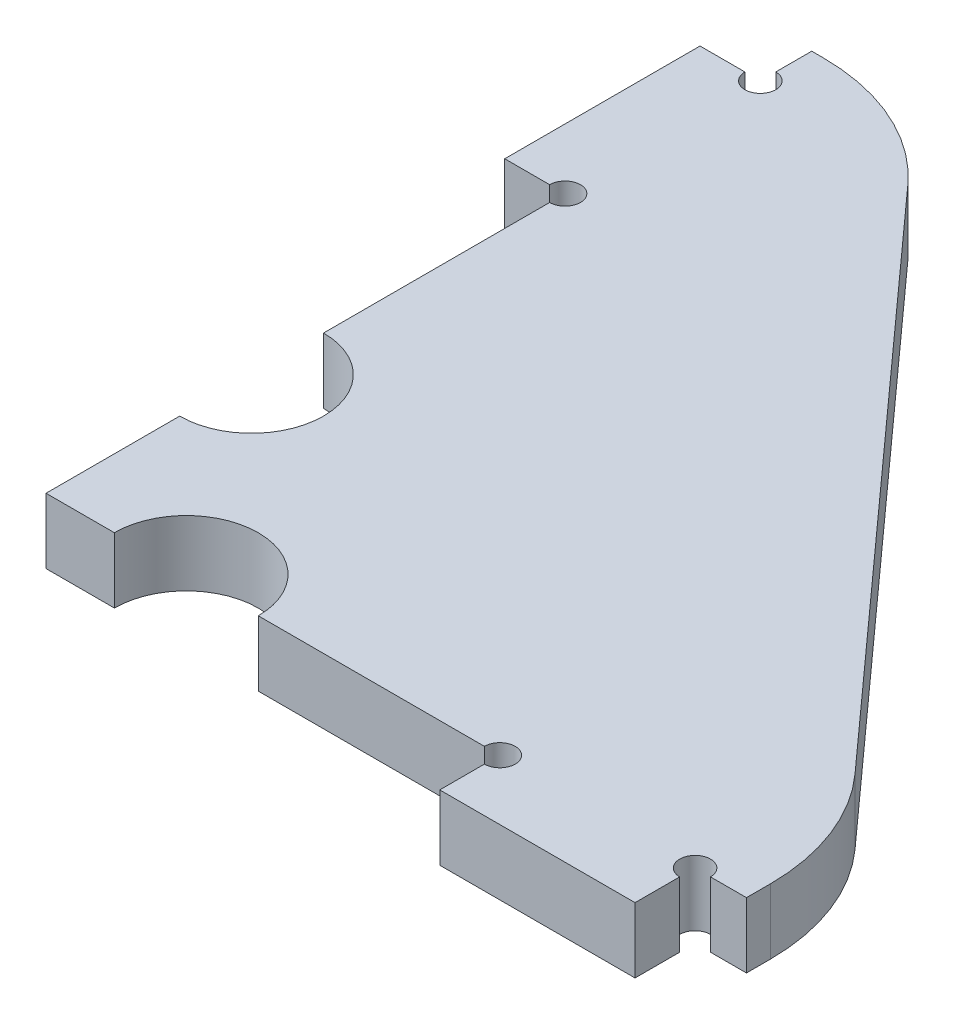
ISO-10303-21;
HEADER;
FILE_DESCRIPTION(('STEP AP214'),'2;1');
FILE_NAME('part.step','',(''),(''),'','','');
FILE_SCHEMA(('AUTOMOTIVE_DESIGN { 1 0 10303 214 1 1 1 1 }'));
ENDSEC;
DATA;
#1=APPLICATION_CONTEXT('core data for automotive mechanical design processes');
#2=APPLICATION_PROTOCOL_DEFINITION('international standard','automotive_design',2000,#1);
#3=PRODUCT_CONTEXT('',#1,'mechanical');
#4=PRODUCT('Part','Part','',(#3));
#5=PRODUCT_RELATED_PRODUCT_CATEGORY('part','',(#4));
#6=PRODUCT_DEFINITION_FORMATION('','',#4);
#7=PRODUCT_DEFINITION_CONTEXT('part definition',#1,'design');
#8=PRODUCT_DEFINITION('design','',#6,#7);
#9=PRODUCT_DEFINITION_SHAPE('','',#8);
#10=(LENGTH_UNIT() NAMED_UNIT(*) SI_UNIT(.MILLI.,.METRE.));
#11=(NAMED_UNIT(*) PLANE_ANGLE_UNIT() SI_UNIT($,.RADIAN.));
#12=(NAMED_UNIT(*) SI_UNIT($,.STERADIAN.) SOLID_ANGLE_UNIT());
#13=UNCERTAINTY_MEASURE_WITH_UNIT(LENGTH_MEASURE(1.E-05),#10,'distance_accuracy_value','');
#14=(GEOMETRIC_REPRESENTATION_CONTEXT(3) GLOBAL_UNCERTAINTY_ASSIGNED_CONTEXT((#13)) GLOBAL_UNIT_ASSIGNED_CONTEXT((#10,
#11,#12)) REPRESENTATION_CONTEXT('',''));
#15=CARTESIAN_POINT('',(0.,0.,0.));
#16=DIRECTION('',(0.,0.,1.));
#17=DIRECTION('',(1.,0.,0.));
#18=AXIS2_PLACEMENT_3D('',#15,#16,#17);
#19=CARTESIAN_POINT('',(0.,6.35,0.));
#20=DIRECTION('',(1.,0.,0.));
#21=DIRECTION('',(0.,0.,-1.));
#22=AXIS2_PLACEMENT_3D('',#19,#20,#21);
#23=PLANE('',#22);
#24=DIRECTION('',(0.,0.,1.));
#25=VECTOR('',#24,1.);
#26=CARTESIAN_POINT('',(0.,6.35,0.));
#27=LINE('',#26,#25);
#28=CARTESIAN_POINT('',(0.,6.35,-49.));
#29=VERTEX_POINT('',#28);
#30=CARTESIAN_POINT('',(0.,6.35,-27.));
#31=VERTEX_POINT('',#30);
#32=EDGE_CURVE('E417',#29,#31,#27,.T.);
#33=ORIENTED_EDGE('',*,*,#32,.F.);
#34=DIRECTION('',(0.,1.,0.));
#35=VECTOR('',#34,1.);
#36=CARTESIAN_POINT('',(0.,0.,-49.));
#37=LINE('',#36,#35);
#38=CARTESIAN_POINT('',(0.,0.,-49.));
#39=VERTEX_POINT('',#38);
#40=EDGE_CURVE('E400',#29,#39,#37,.F.);
#41=ORIENTED_EDGE('',*,*,#40,.T.);
#42=DIRECTION('',(0.,0.,1.));
#43=VECTOR('',#42,1.);
#44=CARTESIAN_POINT('',(0.,0.,0.));
#45=LINE('',#44,#43);
#46=CARTESIAN_POINT('',(0.,0.,-27.));
#47=VERTEX_POINT('',#46);
#48=EDGE_CURVE('E229',#39,#47,#45,.T.);
#49=ORIENTED_EDGE('',*,*,#48,.T.);
#50=DIRECTION('',(0.,1.,0.));
#51=VECTOR('',#50,1.);
#52=CARTESIAN_POINT('',(0.,0.,-27.));
#53=LINE('',#52,#51);
#54=EDGE_CURVE('E203',#47,#31,#53,.T.);
#55=ORIENTED_EDGE('',*,*,#54,.T.);
#56=EDGE_LOOP('',(#33,#41,#49,#55));
#57=FACE_BOUND('',#56,.T.);
#58=ADVANCED_FACE('F39',(#57),#23,.F.);
#59=CARTESIAN_POINT('',(0.,6.35,0.));
#60=DIRECTION('',(0.,0.,-1.));
#61=DIRECTION('',(-1.,0.,0.));
#62=AXIS2_PLACEMENT_3D('',#59,#60,#61);
#63=PLANE('',#62);
#64=DIRECTION('',(1.,0.,0.));
#65=VECTOR('',#64,1.);
#66=CARTESIAN_POINT('',(0.,0.,0.));
#67=LINE('',#66,#65);
#68=CARTESIAN_POINT('',(0.,0.,0.));
#69=VERTEX_POINT('',#68);
#70=CARTESIAN_POINT('',(6.65,0.,0.));
#71=VERTEX_POINT('',#70);
#72=EDGE_CURVE('E226',#69,#71,#67,.T.);
#73=ORIENTED_EDGE('',*,*,#72,.T.);
#74=DIRECTION('',(0.,1.,0.));
#75=VECTOR('',#74,1.);
#76=CARTESIAN_POINT('',(6.65,0.,0.));
#77=LINE('',#76,#75);
#78=CARTESIAN_POINT('',(6.65,6.35,0.));
#79=VERTEX_POINT('',#78);
#80=EDGE_CURVE('E408',#71,#79,#77,.T.);
#81=ORIENTED_EDGE('',*,*,#80,.T.);
#82=DIRECTION('',(1.,0.,0.));
#83=VECTOR('',#82,1.);
#84=CARTESIAN_POINT('',(0.,6.35,0.));
#85=LINE('',#84,#83);
#86=CARTESIAN_POINT('',(0.,6.35,0.));
#87=VERTEX_POINT('',#86);
#88=EDGE_CURVE('E418',#87,#79,#85,.T.);
#89=ORIENTED_EDGE('',*,*,#88,.F.);
#90=DIRECTION('',(0.,-1.,0.));
#91=VECTOR('',#90,1.);
#92=CARTESIAN_POINT('',(0.,6.35,0.));
#93=LINE('',#92,#91);
#94=EDGE_CURVE('E305',#87,#69,#93,.T.);
#95=ORIENTED_EDGE('',*,*,#94,.T.);
#96=EDGE_LOOP('',(#73,#81,#89,#95));
#97=FACE_BOUND('',#96,.T.);
#98=ADVANCED_FACE('F497',(#97),#63,.F.);
#99=CARTESIAN_POINT('',(0.,6.35,-13.));
#100=VERTEX_POINT('',#99);
#101=EDGE_CURVE('E218',#100,#87,#27,.T.);
#102=ORIENTED_EDGE('',*,*,#101,.F.);
#103=DIRECTION('',(0.,1.,0.));
#104=VECTOR('',#103,1.);
#105=CARTESIAN_POINT('',(0.,0.,-13.));
#106=LINE('',#105,#104);
#107=CARTESIAN_POINT('',(0.,0.,-13.));
#108=VERTEX_POINT('',#107);
#109=EDGE_CURVE('E200',#100,#108,#106,.F.);
#110=ORIENTED_EDGE('',*,*,#109,.T.);
#111=EDGE_CURVE('E216',#108,#69,#45,.T.);
#112=ORIENTED_EDGE('',*,*,#111,.T.);
#113=ORIENTED_EDGE('',*,*,#94,.F.);
#114=EDGE_LOOP('',(#102,#110,#112,#113));
#115=FACE_BOUND('',#114,.T.);
#116=ADVANCED_FACE('F214',(#115),#23,.F.);
#117=CARTESIAN_POINT('',(20.65,6.35,0.));
#118=VERTEX_POINT('',#117);
#119=CARTESIAN_POINT('',(42.65,6.35,0.));
#120=VERTEX_POINT('',#119);
#121=EDGE_CURVE('E422',#118,#120,#85,.T.);
#122=ORIENTED_EDGE('',*,*,#121,.F.);
#123=DIRECTION('',(0.,1.,0.));
#124=VECTOR('',#123,1.);
#125=CARTESIAN_POINT('',(20.65,0.,0.));
#126=LINE('',#125,#124);
#127=CARTESIAN_POINT('',(20.65,0.,0.));
#128=VERTEX_POINT('',#127);
#129=EDGE_CURVE('E404',#118,#128,#126,.F.);
#130=ORIENTED_EDGE('',*,*,#129,.T.);
#131=CARTESIAN_POINT('',(42.65,0.,0.));
#132=VERTEX_POINT('',#131);
#133=EDGE_CURVE('E234',#128,#132,#67,.T.);
#134=ORIENTED_EDGE('',*,*,#133,.T.);
#135=DIRECTION('',(0.,1.,0.));
#136=VECTOR('',#135,1.);
#137=CARTESIAN_POINT('',(42.65,0.,0.));
#138=LINE('',#137,#136);
#139=EDGE_CURVE('E387',#132,#120,#138,.T.);
#140=ORIENTED_EDGE('',*,*,#139,.T.);
#141=EDGE_LOOP('',(#122,#130,#134,#140));
#142=FACE_BOUND('',#141,.T.);
#143=ADVANCED_FACE('F483',(#142),#63,.F.);
#144=CARTESIAN_POINT('',(44.15,6.35,0.));
#145=DIRECTION('',(1.,0.,0.));
#146=DIRECTION('',(0.,0.,-1.));
#147=AXIS2_PLACEMENT_3D('',#144,#145,#146);
#148=PLANE('',#147);
#149=DIRECTION('',(0.,0.,1.));
#150=VECTOR('',#149,1.);
#151=CARTESIAN_POINT('',(44.15,6.35,0.));
#152=LINE('',#151,#150);
#153=CARTESIAN_POINT('',(44.15,6.35,1.5));
#154=VERTEX_POINT('',#153);
#155=CARTESIAN_POINT('',(44.15,6.35,5.842));
#156=VERTEX_POINT('',#155);
#157=EDGE_CURVE('E383',#154,#156,#152,.T.);
#158=ORIENTED_EDGE('',*,*,#157,.F.);
#159=DIRECTION('',(0.,1.,0.));
#160=VECTOR('',#159,1.);
#161=CARTESIAN_POINT('',(44.15,0.,1.5));
#162=LINE('',#161,#160);
#163=CARTESIAN_POINT('',(44.15,0.,1.5));
#164=VERTEX_POINT('',#163);
#165=EDGE_CURVE('E382',#154,#164,#162,.F.);
#166=ORIENTED_EDGE('',*,*,#165,.T.);
#167=DIRECTION('',(0.,0.,1.));
#168=VECTOR('',#167,1.);
#169=CARTESIAN_POINT('',(44.15,0.,0.));
#170=LINE('',#169,#168);
#171=CARTESIAN_POINT('',(44.15,0.,5.842));
#172=VERTEX_POINT('',#171);
#173=EDGE_CURVE('E244',#164,#172,#170,.T.);
#174=ORIENTED_EDGE('',*,*,#173,.T.);
#175=DIRECTION('',(0.,-1.,0.));
#176=VECTOR('',#175,1.);
#177=CARTESIAN_POINT('',(44.15,6.35,5.842));
#178=LINE('',#177,#176);
#179=EDGE_CURVE('E301',#156,#172,#178,.T.);
#180=ORIENTED_EDGE('',*,*,#179,.F.);
#181=EDGE_LOOP('',(#158,#166,#174,#180));
#182=FACE_BOUND('',#181,.T.);
#183=ADVANCED_FACE('F381',(#182),#148,.F.);
#184=CARTESIAN_POINT('',(44.15,6.35,5.842));
#185=DIRECTION('',(0.,0.,-1.));
#186=DIRECTION('',(-1.,0.,0.));
#187=AXIS2_PLACEMENT_3D('',#184,#185,#186);
#188=PLANE('',#187);
#189=DIRECTION('',(1.,0.,0.));
#190=VECTOR('',#189,1.);
#191=CARTESIAN_POINT('',(44.15,0.,5.842));
#192=LINE('',#191,#190);
#193=CARTESIAN_POINT('',(63.15,0.,5.842));
#194=VERTEX_POINT('',#193);
#195=EDGE_CURVE('E247',#172,#194,#192,.T.);
#196=ORIENTED_EDGE('',*,*,#195,.T.);
#197=DIRECTION('',(0.,-1.,0.));
#198=VECTOR('',#197,1.);
#199=CARTESIAN_POINT('',(63.15,6.35,5.842));
#200=LINE('',#199,#198);
#201=CARTESIAN_POINT('',(63.15,6.35,5.842));
#202=VERTEX_POINT('',#201);
#203=EDGE_CURVE('E297',#202,#194,#200,.T.);
#204=ORIENTED_EDGE('',*,*,#203,.F.);
#205=DIRECTION('',(1.,0.,0.));
#206=VECTOR('',#205,1.);
#207=CARTESIAN_POINT('',(44.15,6.35,5.842));
#208=LINE('',#207,#206);
#209=EDGE_CURVE('E371',#156,#202,#208,.T.);
#210=ORIENTED_EDGE('',*,*,#209,.F.);
#211=ORIENTED_EDGE('',*,*,#179,.T.);
#212=EDGE_LOOP('',(#196,#204,#210,#211));
#213=FACE_BOUND('',#212,.T.);
#214=ADVANCED_FACE('F370',(#213),#188,.F.);
#215=CARTESIAN_POINT('',(63.15,6.35,5.842));
#216=DIRECTION('',(-1.,0.,0.));
#217=DIRECTION('',(0.,0.,1.));
#218=AXIS2_PLACEMENT_3D('',#215,#216,#217);
#219=PLANE('',#218);
#220=DIRECTION('',(0.,0.,-1.));
#221=VECTOR('',#220,1.);
#222=CARTESIAN_POINT('',(63.15,0.,5.842));
#223=LINE('',#222,#221);
#224=CARTESIAN_POINT('',(63.15,0.,1.5));
#225=VERTEX_POINT('',#224);
#226=EDGE_CURVE('E250',#194,#225,#223,.T.);
#227=ORIENTED_EDGE('',*,*,#226,.T.);
#228=DIRECTION('',(0.,1.,0.));
#229=VECTOR('',#228,1.);
#230=CARTESIAN_POINT('',(63.15,0.,1.5));
#231=LINE('',#230,#229);
#232=CARTESIAN_POINT('',(63.15,6.35,1.5));
#233=VERTEX_POINT('',#232);
#234=EDGE_CURVE('E364',#225,#233,#231,.T.);
#235=ORIENTED_EDGE('',*,*,#234,.T.);
#236=DIRECTION('',(0.,0.,-1.));
#237=VECTOR('',#236,1.);
#238=CARTESIAN_POINT('',(63.15,6.35,5.842));
#239=LINE('',#238,#237);
#240=EDGE_CURVE('E367',#202,#233,#239,.T.);
#241=ORIENTED_EDGE('',*,*,#240,.F.);
#242=ORIENTED_EDGE('',*,*,#203,.T.);
#243=EDGE_LOOP('',(#227,#235,#241,#242));
#244=FACE_BOUND('',#243,.T.);
#245=ADVANCED_FACE('F362',(#244),#219,.F.);
#246=CARTESIAN_POINT('',(63.15,6.35,0.));
#247=DIRECTION('',(0.,0.,-1.));
#248=DIRECTION('',(-1.,0.,0.));
#249=AXIS2_PLACEMENT_3D('',#246,#247,#248);
#250=PLANE('',#249);
#251=DIRECTION('',(1.,0.,0.));
#252=VECTOR('',#251,1.);
#253=CARTESIAN_POINT('',(63.15,6.35,0.));
#254=LINE('',#253,#252);
#255=CARTESIAN_POINT('',(64.65,6.35,0.));
#256=VERTEX_POINT('',#255);
#257=CARTESIAN_POINT('',(68.15,6.35,0.));
#258=VERTEX_POINT('',#257);
#259=EDGE_CURVE('E355',#256,#258,#254,.T.);
#260=ORIENTED_EDGE('',*,*,#259,.F.);
#261=DIRECTION('',(0.,1.,0.));
#262=VECTOR('',#261,1.);
#263=CARTESIAN_POINT('',(64.65,0.,0.));
#264=LINE('',#263,#262);
#265=CARTESIAN_POINT('',(64.65,0.,0.));
#266=VERTEX_POINT('',#265);
#267=EDGE_CURVE('E356',#256,#266,#264,.F.);
#268=ORIENTED_EDGE('',*,*,#267,.T.);
#269=DIRECTION('',(1.,0.,0.));
#270=VECTOR('',#269,1.);
#271=CARTESIAN_POINT('',(63.15,0.,0.));
#272=LINE('',#271,#270);
#273=CARTESIAN_POINT('',(68.15,0.,0.));
#274=VERTEX_POINT('',#273);
#275=EDGE_CURVE('E254',#266,#274,#272,.T.);
#276=ORIENTED_EDGE('',*,*,#275,.T.);
#277=DIRECTION('',(0.,-1.,0.));
#278=VECTOR('',#277,1.);
#279=CARTESIAN_POINT('',(68.15,6.35,0.));
#280=LINE('',#279,#278);
#281=EDGE_CURVE('E293',#258,#274,#280,.T.);
#282=ORIENTED_EDGE('',*,*,#281,.F.);
#283=EDGE_LOOP('',(#260,#268,#276,#282));
#284=FACE_BOUND('',#283,.T.);
#285=ADVANCED_FACE('F353',(#284),#250,.F.);
#286=CARTESIAN_POINT('',(68.15,6.35,0.));
#287=DIRECTION('',(-1.,0.,0.));
#288=DIRECTION('',(0.,0.,1.));
#289=AXIS2_PLACEMENT_3D('',#286,#287,#288);
#290=PLANE('',#289);
#291=DIRECTION('',(0.,0.,-1.));
#292=VECTOR('',#291,1.);
#293=CARTESIAN_POINT('',(68.15,0.,0.));
#294=LINE('',#293,#292);
#295=CARTESIAN_POINT('',(68.15,0.,-2.31545885250263));
#296=VERTEX_POINT('',#295);
#297=EDGE_CURVE('E257',#274,#296,#294,.T.);
#298=ORIENTED_EDGE('',*,*,#297,.T.);
#299=DIRECTION('',(0.,-1.,0.));
#300=VECTOR('',#299,1.);
#301=CARTESIAN_POINT('',(68.15,6.35,-2.31545885250263));
#302=LINE('',#301,#300);
#303=CARTESIAN_POINT('',(68.15,6.35,-2.31545885250263));
#304=VERTEX_POINT('',#303);
#305=EDGE_CURVE('E63',#296,#304,#302,.F.);
#306=ORIENTED_EDGE('',*,*,#305,.T.);
#307=DIRECTION('',(0.,0.,-1.));
#308=VECTOR('',#307,1.);
#309=CARTESIAN_POINT('',(68.15,6.35,0.));
#310=LINE('',#309,#308);
#311=EDGE_CURVE('E337',#258,#304,#310,.T.);
#312=ORIENTED_EDGE('',*,*,#311,.F.);
#313=ORIENTED_EDGE('',*,*,#281,.T.);
#314=EDGE_LOOP('',(#298,#306,#312,#313));
#315=FACE_BOUND('',#314,.T.);
#316=ADVANCED_FACE('F349',(#315),#290,.F.);
#317=CARTESIAN_POINT('',(10.,6.35,-74.5));
#318=DIRECTION('',(-0.742721301994947,0.,0.669600677690018));
#319=DIRECTION('',(0.669600677690018,0.,0.742721301994947));
#320=AXIS2_PLACEMENT_3D('',#317,#318,#319);
#321=PLANE('',#320);
#322=DIRECTION('',(-0.669600677690018,0.,-0.742721301994947));
#323=VECTOR('',#322,1.);
#324=CARTESIAN_POINT('',(10.,6.35,-74.5));
#325=LINE('',#324,#323);
#326=CARTESIAN_POINT('',(63.0044260398989,6.35,-15.707472406303));
#327=VERTEX_POINT('',#326);
#328=CARTESIAN_POINT('',(15.9574327418064,6.35,-67.8920135538004));
#329=VERTEX_POINT('',#328);
#330=EDGE_CURVE('E336',#327,#329,#325,.T.);
#331=ORIENTED_EDGE('',*,*,#330,.F.);
#332=DIRECTION('',(0.,-1.,0.));
#333=VECTOR('',#332,1.);
#334=CARTESIAN_POINT('',(63.0044260398989,6.35,-15.707472406303));
#335=LINE('',#334,#333);
#336=CARTESIAN_POINT('',(63.0044260398989,0.,-15.707472406303));
#337=VERTEX_POINT('',#336);
#338=EDGE_CURVE('E319',#327,#337,#335,.T.);
#339=ORIENTED_EDGE('',*,*,#338,.T.);
#340=DIRECTION('',(-0.669600677690018,0.,-0.742721301994947));
#341=VECTOR('',#340,1.);
#342=CARTESIAN_POINT('',(10.,0.,-74.5));
#343=LINE('',#342,#341);
#344=CARTESIAN_POINT('',(15.9574327418064,0.,-67.8920135538004));
#345=VERTEX_POINT('',#344);
#346=EDGE_CURVE('E260',#337,#345,#343,.T.);
#347=ORIENTED_EDGE('',*,*,#346,.T.);
#348=DIRECTION('',(0.,-1.,0.));
#349=VECTOR('',#348,1.);
#350=CARTESIAN_POINT('',(15.9574327418064,6.35,-67.8920135538004));
#351=LINE('',#350,#349);
#352=EDGE_CURVE('E316',#345,#329,#351,.F.);
#353=ORIENTED_EDGE('',*,*,#352,.T.);
#354=EDGE_LOOP('',(#331,#339,#347,#353));
#355=FACE_BOUND('',#354,.T.);
#356=ADVANCED_FACE('F341',(#355),#321,.F.);
#357=CARTESIAN_POINT('',(0.,6.35,-74.5));
#358=DIRECTION('',(0.,0.,1.));
#359=DIRECTION('',(1.,0.,0.));
#360=AXIS2_PLACEMENT_3D('',#357,#358,#359);
#361=PLANE('',#360);
#362=DIRECTION('',(-1.,0.,0.));
#363=VECTOR('',#362,1.);
#364=CARTESIAN_POINT('',(0.,6.35,-74.5));
#365=LINE('',#364,#363);
#366=CARTESIAN_POINT('',(1.10300670190741,6.35,-74.5));
#367=VERTEX_POINT('',#366);
#368=CARTESIAN_POINT('',(0.,6.35,-74.5));
#369=VERTEX_POINT('',#368);
#370=EDGE_CURVE('E344',#367,#369,#365,.T.);
#371=ORIENTED_EDGE('',*,*,#370,.F.);
#372=DIRECTION('',(0.,-1.,0.));
#373=VECTOR('',#372,1.);
#374=CARTESIAN_POINT('',(1.10300670190741,6.35,-74.5));
#375=LINE('',#374,#373);
#376=CARTESIAN_POINT('',(1.10300670190741,0.,-74.5));
#377=VERTEX_POINT('',#376);
#378=EDGE_CURVE('E11',#367,#377,#375,.T.);
#379=ORIENTED_EDGE('',*,*,#378,.T.);
#380=DIRECTION('',(-1.,0.,0.));
#381=VECTOR('',#380,1.);
#382=CARTESIAN_POINT('',(0.,0.,-74.5));
#383=LINE('',#382,#381);
#384=CARTESIAN_POINT('',(0.,0.,-74.5));
#385=VERTEX_POINT('',#384);
#386=EDGE_CURVE('E264',#377,#385,#383,.T.);
#387=ORIENTED_EDGE('',*,*,#386,.T.);
#388=DIRECTION('',(0.,-1.,0.));
#389=VECTOR('',#388,1.);
#390=CARTESIAN_POINT('',(0.,6.35,-74.5));
#391=LINE('',#390,#389);
#392=EDGE_CURVE('E289',#369,#385,#391,.T.);
#393=ORIENTED_EDGE('',*,*,#392,.F.);
#394=EDGE_LOOP('',(#371,#379,#387,#393));
#395=FACE_BOUND('',#394,.T.);
#396=ADVANCED_FACE('F523',(#395),#361,.F.);
#397=CARTESIAN_POINT('',(0.,6.35,-69.5));
#398=DIRECTION('',(1.,0.,0.));
#399=DIRECTION('',(0.,0.,-1.));
#400=AXIS2_PLACEMENT_3D('',#397,#398,#399);
#401=PLANE('',#400);
#402=DIRECTION('',(0.,0.,1.));
#403=VECTOR('',#402,1.);
#404=CARTESIAN_POINT('',(0.,0.,-69.5));
#405=LINE('',#404,#403);
#406=CARTESIAN_POINT('',(0.,0.,-71.));
#407=VERTEX_POINT('',#406);
#408=EDGE_CURVE('E267',#385,#407,#405,.T.);
#409=ORIENTED_EDGE('',*,*,#408,.T.);
#410=DIRECTION('',(0.,1.,0.));
#411=VECTOR('',#410,1.);
#412=CARTESIAN_POINT('',(0.,0.,-71.));
#413=LINE('',#412,#411);
#414=CARTESIAN_POINT('',(0.,6.35,-71.));
#415=VERTEX_POINT('',#414);
#416=EDGE_CURVE('E230',#407,#415,#413,.T.);
#417=ORIENTED_EDGE('',*,*,#416,.T.);
#418=DIRECTION('',(0.,0.,1.));
#419=VECTOR('',#418,1.);
#420=CARTESIAN_POINT('',(0.,6.35,-69.5));
#421=LINE('',#420,#419);
#422=EDGE_CURVE('E435',#369,#415,#421,.T.);
#423=ORIENTED_EDGE('',*,*,#422,.F.);
#424=ORIENTED_EDGE('',*,*,#392,.T.);
#425=EDGE_LOOP('',(#409,#417,#423,#424));
#426=FACE_BOUND('',#425,.T.);
#427=ADVANCED_FACE('F526',(#426),#401,.F.);
#428=CARTESIAN_POINT('',(-5.87,6.35,-69.5));
#429=DIRECTION('',(0.,0.,1.));
#430=DIRECTION('',(1.,0.,0.));
#431=AXIS2_PLACEMENT_3D('',#428,#429,#430);
#432=PLANE('',#431);
#433=DIRECTION('',(-1.,0.,0.));
#434=VECTOR('',#433,1.);
#435=CARTESIAN_POINT('',(-5.87,6.35,-69.5));
#436=LINE('',#435,#434);
#437=CARTESIAN_POINT('',(-1.5,6.35,-69.5));
#438=VERTEX_POINT('',#437);
#439=CARTESIAN_POINT('',(-5.87,6.35,-69.5));
#440=VERTEX_POINT('',#439);
#441=EDGE_CURVE('E439',#438,#440,#436,.T.);
#442=ORIENTED_EDGE('',*,*,#441,.F.);
#443=DIRECTION('',(0.,1.,0.));
#444=VECTOR('',#443,1.);
#445=CARTESIAN_POINT('',(-1.5,0.,-69.5));
#446=LINE('',#445,#444);
#447=CARTESIAN_POINT('',(-1.5,0.,-69.5));
#448=VERTEX_POINT('',#447);
#449=EDGE_CURVE('E236',#438,#448,#446,.F.);
#450=ORIENTED_EDGE('',*,*,#449,.T.);
#451=DIRECTION('',(-1.,0.,0.));
#452=VECTOR('',#451,1.);
#453=CARTESIAN_POINT('',(-5.87,0.,-69.5));
#454=LINE('',#453,#452);
#455=CARTESIAN_POINT('',(-5.87,0.,-69.5));
#456=VERTEX_POINT('',#455);
#457=EDGE_CURVE('E271',#448,#456,#454,.T.);
#458=ORIENTED_EDGE('',*,*,#457,.T.);
#459=DIRECTION('',(0.,-1.,0.));
#460=VECTOR('',#459,1.);
#461=CARTESIAN_POINT('',(-5.87,6.35,-69.5));
#462=LINE('',#461,#460);
#463=EDGE_CURVE('E285',#440,#456,#462,.T.);
#464=ORIENTED_EDGE('',*,*,#463,.F.);
#465=EDGE_LOOP('',(#442,#450,#458,#464));
#466=FACE_BOUND('',#465,.T.);
#467=ADVANCED_FACE('F530',(#466),#432,.F.);
#468=CARTESIAN_POINT('',(-5.87,6.35,-50.5));
#469=DIRECTION('',(1.,0.,0.));
#470=DIRECTION('',(0.,0.,-1.));
#471=AXIS2_PLACEMENT_3D('',#468,#469,#470);
#472=PLANE('',#471);
#473=DIRECTION('',(0.,0.,1.));
#474=VECTOR('',#473,1.);
#475=CARTESIAN_POINT('',(-5.87,0.,-50.5));
#476=LINE('',#475,#474);
#477=CARTESIAN_POINT('',(-5.87,0.,-50.5));
#478=VERTEX_POINT('',#477);
#479=EDGE_CURVE('E274',#456,#478,#476,.T.);
#480=ORIENTED_EDGE('',*,*,#479,.T.);
#481=DIRECTION('',(0.,-1.,0.));
#482=VECTOR('',#481,1.);
#483=CARTESIAN_POINT('',(-5.87,6.35,-50.5));
#484=LINE('',#483,#482);
#485=CARTESIAN_POINT('',(-5.87,6.35,-50.5));
#486=VERTEX_POINT('',#485);
#487=EDGE_CURVE('E281',#486,#478,#484,.T.);
#488=ORIENTED_EDGE('',*,*,#487,.F.);
#489=DIRECTION('',(0.,0.,1.));
#490=VECTOR('',#489,1.);
#491=CARTESIAN_POINT('',(-5.87,6.35,-50.5));
#492=LINE('',#491,#490);
#493=EDGE_CURVE('E441',#440,#486,#492,.T.);
#494=ORIENTED_EDGE('',*,*,#493,.F.);
#495=ORIENTED_EDGE('',*,*,#463,.T.);
#496=EDGE_LOOP('',(#480,#488,#494,#495));
#497=FACE_BOUND('',#496,.T.);
#498=ADVANCED_FACE('F534',(#497),#472,.F.);
#499=CARTESIAN_POINT('',(0.,6.35,-50.5));
#500=DIRECTION('',(0.,0.,-1.));
#501=DIRECTION('',(-1.,0.,0.));
#502=AXIS2_PLACEMENT_3D('',#499,#500,#501);
#503=PLANE('',#502);
#504=DIRECTION('',(1.,0.,0.));
#505=VECTOR('',#504,1.);
#506=CARTESIAN_POINT('',(0.,0.,-50.5));
#507=LINE('',#506,#505);
#508=CARTESIAN_POINT('',(-1.5,0.,-50.5));
#509=VERTEX_POINT('',#508);
#510=EDGE_CURVE('E277',#478,#509,#507,.T.);
#511=ORIENTED_EDGE('',*,*,#510,.T.);
#512=DIRECTION('',(0.,1.,0.));
#513=VECTOR('',#512,1.);
#514=CARTESIAN_POINT('',(-1.5,0.,-50.5));
#515=LINE('',#514,#513);
#516=CARTESIAN_POINT('',(-1.5,6.35,-50.5));
#517=VERTEX_POINT('',#516);
#518=EDGE_CURVE('E392',#509,#517,#515,.T.);
#519=ORIENTED_EDGE('',*,*,#518,.T.);
#520=DIRECTION('',(1.,0.,0.));
#521=VECTOR('',#520,1.);
#522=CARTESIAN_POINT('',(0.,6.35,-50.5));
#523=LINE('',#522,#521);
#524=EDGE_CURVE('E240',#486,#517,#523,.T.);
#525=ORIENTED_EDGE('',*,*,#524,.F.);
#526=ORIENTED_EDGE('',*,*,#487,.T.);
#527=EDGE_LOOP('',(#511,#519,#525,#526));
#528=FACE_BOUND('',#527,.T.);
#529=ADVANCED_FACE('F453',(#528),#503,.F.);
#530=CARTESIAN_POINT('',(0.,6.35,0.));
#531=DIRECTION('',(0.,1.,0.));
#532=DIRECTION('',(0.,0.,1.));
#533=AXIS2_PLACEMENT_3D('',#530,#531,#532);
#534=PLANE('',#533);
#535=ORIENTED_EDGE('',*,*,#311,.T.);
#536=CARTESIAN_POINT('',(48.15,6.35,-2.31545885250263));
#537=DIRECTION('',(0.,1.,0.));
#538=DIRECTION('',(0.,0.,1.));
#539=AXIS2_PLACEMENT_3D('',#536,#537,#538);
#540=CIRCLE('',#539,20.);
#541=EDGE_CURVE('E48',#304,#327,#540,.T.);
#542=ORIENTED_EDGE('',*,*,#541,.T.);
#543=ORIENTED_EDGE('',*,*,#330,.T.);
#544=CARTESIAN_POINT('',(1.10300670190741,6.35,-54.5));
#545=DIRECTION('',(0.,1.,0.));
#546=DIRECTION('',(0.,0.,1.));
#547=AXIS2_PLACEMENT_3D('',#544,#545,#546);
#548=CIRCLE('',#547,20.);
#549=EDGE_CURVE('E55',#329,#367,#548,.T.);
#550=ORIENTED_EDGE('',*,*,#549,.T.);
#551=ORIENTED_EDGE('',*,*,#370,.T.);
#552=ORIENTED_EDGE('',*,*,#422,.T.);
#553=CARTESIAN_POINT('',(0.,6.35,-69.5));
#554=DIRECTION('',(0.,1.,0.));
#555=DIRECTION('',(0.,0.,1.));
#556=AXIS2_PLACEMENT_3D('',#553,#554,#555);
#557=CIRCLE('',#556,1.5);
#558=EDGE_CURVE('E220',#438,#415,#557,.T.);
#559=ORIENTED_EDGE('',*,*,#558,.F.);
#560=ORIENTED_EDGE('',*,*,#441,.T.);
#561=ORIENTED_EDGE('',*,*,#493,.T.);
#562=ORIENTED_EDGE('',*,*,#524,.T.);
#563=CARTESIAN_POINT('',(0.,6.35,-50.5));
#564=DIRECTION('',(0.,1.,0.));
#565=DIRECTION('',(0.,0.,1.));
#566=AXIS2_PLACEMENT_3D('',#563,#564,#565);
#567=CIRCLE('',#566,1.5);
#568=EDGE_CURVE('E450',#29,#517,#567,.T.);
#569=ORIENTED_EDGE('',*,*,#568,.F.);
#570=ORIENTED_EDGE('',*,*,#32,.T.);
#571=CARTESIAN_POINT('',(0.,6.35,-20.));
#572=DIRECTION('',(0.,1.,0.));
#573=DIRECTION('',(0.,0.,1.));
#574=AXIS2_PLACEMENT_3D('',#571,#572,#573);
#575=CIRCLE('',#574,7.);
#576=EDGE_CURVE('E210',#100,#31,#575,.T.);
#577=ORIENTED_EDGE('',*,*,#576,.F.);
#578=ORIENTED_EDGE('',*,*,#101,.T.);
#579=ORIENTED_EDGE('',*,*,#88,.T.);
#580=CARTESIAN_POINT('',(13.65,6.35,0.));
#581=DIRECTION('',(0.,1.,0.));
#582=DIRECTION('',(0.,0.,1.));
#583=AXIS2_PLACEMENT_3D('',#580,#581,#582);
#584=CIRCLE('',#583,7.);
#585=EDGE_CURVE('E481',#118,#79,#584,.T.);
#586=ORIENTED_EDGE('',*,*,#585,.F.);
#587=ORIENTED_EDGE('',*,*,#121,.T.);
#588=CARTESIAN_POINT('',(44.15,6.35,0.));
#589=DIRECTION('',(0.,1.,0.));
#590=DIRECTION('',(0.,0.,1.));
#591=AXIS2_PLACEMENT_3D('',#588,#589,#590);
#592=CIRCLE('',#591,1.5);
#593=EDGE_CURVE('E470',#154,#120,#592,.T.);
#594=ORIENTED_EDGE('',*,*,#593,.F.);
#595=ORIENTED_EDGE('',*,*,#157,.T.);
#596=ORIENTED_EDGE('',*,*,#209,.T.);
#597=ORIENTED_EDGE('',*,*,#240,.T.);
#598=CARTESIAN_POINT('',(63.15,6.35,0.));
#599=DIRECTION('',(0.,1.,0.));
#600=DIRECTION('',(0.,0.,1.));
#601=AXIS2_PLACEMENT_3D('',#598,#599,#600);
#602=CIRCLE('',#601,1.5);
#603=EDGE_CURVE('E209',#256,#233,#602,.T.);
#604=ORIENTED_EDGE('',*,*,#603,.F.);
#605=ORIENTED_EDGE('',*,*,#259,.T.);
#606=EDGE_LOOP('',(#535,#542,#543,#550,#551,#552,#559,#560,#561,#562,#569,#570,#577,#578,#579,
#586,#587,#594,#595,#596,#597,#604,#605));
#607=FACE_BOUND('',#606,.T.);
#608=ADVANCED_FACE('F335',(#607),#534,.T.);
#609=CARTESIAN_POINT('',(0.,0.,0.));
#610=DIRECTION('',(0.,1.,0.));
#611=DIRECTION('',(0.,0.,1.));
#612=AXIS2_PLACEMENT_3D('',#609,#610,#611);
#613=PLANE('',#612);
#614=ORIENTED_EDGE('',*,*,#346,.F.);
#615=CARTESIAN_POINT('',(48.15,0.,-2.31545885250263));
#616=DIRECTION('',(0.,1.,0.));
#617=DIRECTION('',(0.,0.,1.));
#618=AXIS2_PLACEMENT_3D('',#615,#616,#617);
#619=CIRCLE('',#618,20.);
#620=EDGE_CURVE('E326',#337,#296,#619,.F.);
#621=ORIENTED_EDGE('',*,*,#620,.T.);
#622=ORIENTED_EDGE('',*,*,#297,.F.);
#623=ORIENTED_EDGE('',*,*,#275,.F.);
#624=CARTESIAN_POINT('',(63.15,0.,0.));
#625=DIRECTION('',(0.,1.,0.));
#626=DIRECTION('',(0.,0.,1.));
#627=AXIS2_PLACEMENT_3D('',#624,#625,#626);
#628=CIRCLE('',#627,1.5);
#629=EDGE_CURVE('E308',#266,#225,#628,.T.);
#630=ORIENTED_EDGE('',*,*,#629,.T.);
#631=ORIENTED_EDGE('',*,*,#226,.F.);
#632=ORIENTED_EDGE('',*,*,#195,.F.);
#633=ORIENTED_EDGE('',*,*,#173,.F.);
#634=CARTESIAN_POINT('',(44.15,0.,0.));
#635=DIRECTION('',(0.,1.,0.));
#636=DIRECTION('',(0.,0.,1.));
#637=AXIS2_PLACEMENT_3D('',#634,#635,#636);
#638=CIRCLE('',#637,1.5);
#639=EDGE_CURVE('E376',#164,#132,#638,.T.);
#640=ORIENTED_EDGE('',*,*,#639,.T.);
#641=ORIENTED_EDGE('',*,*,#133,.F.);
#642=CARTESIAN_POINT('',(13.65,0.,0.));
#643=DIRECTION('',(0.,1.,0.));
#644=DIRECTION('',(0.,0.,1.));
#645=AXIS2_PLACEMENT_3D('',#642,#643,#644);
#646=CIRCLE('',#645,7.);
#647=EDGE_CURVE('E706',#128,#71,#646,.T.);
#648=ORIENTED_EDGE('',*,*,#647,.T.);
#649=ORIENTED_EDGE('',*,*,#72,.F.);
#650=ORIENTED_EDGE('',*,*,#111,.F.);
#651=CARTESIAN_POINT('',(0.,0.,-20.));
#652=DIRECTION('',(0.,1.,0.));
#653=DIRECTION('',(0.,0.,1.));
#654=AXIS2_PLACEMENT_3D('',#651,#652,#653);
#655=CIRCLE('',#654,7.);
#656=EDGE_CURVE('E197',#108,#47,#655,.T.);
#657=ORIENTED_EDGE('',*,*,#656,.T.);
#658=ORIENTED_EDGE('',*,*,#48,.F.);
#659=CARTESIAN_POINT('',(0.,0.,-50.5));
#660=DIRECTION('',(0.,1.,0.));
#661=DIRECTION('',(0.,0.,1.));
#662=AXIS2_PLACEMENT_3D('',#659,#660,#661);
#663=CIRCLE('',#662,1.5);
#664=EDGE_CURVE('E458',#39,#509,#663,.T.);
#665=ORIENTED_EDGE('',*,*,#664,.T.);
#666=ORIENTED_EDGE('',*,*,#510,.F.);
#667=ORIENTED_EDGE('',*,*,#479,.F.);
#668=ORIENTED_EDGE('',*,*,#457,.F.);
#669=CARTESIAN_POINT('',(0.,0.,-69.5));
#670=DIRECTION('',(0.,1.,0.));
#671=DIRECTION('',(0.,0.,1.));
#672=AXIS2_PLACEMENT_3D('',#669,#670,#671);
#673=CIRCLE('',#672,1.5);
#674=EDGE_CURVE('E312',#448,#407,#673,.T.);
#675=ORIENTED_EDGE('',*,*,#674,.T.);
#676=ORIENTED_EDGE('',*,*,#408,.F.);
#677=ORIENTED_EDGE('',*,*,#386,.F.);
#678=CARTESIAN_POINT('',(1.10300670190741,0.,-54.5));
#679=DIRECTION('',(0.,1.,0.));
#680=DIRECTION('',(0.,0.,1.));
#681=AXIS2_PLACEMENT_3D('',#678,#679,#680);
#682=CIRCLE('',#681,20.);
#683=EDGE_CURVE('E323',#377,#345,#682,.F.);
#684=ORIENTED_EDGE('',*,*,#683,.T.);
#685=EDGE_LOOP('',(#614,#621,#622,#623,#630,#631,#632,#633,#640,#641,#648,#649,#650,#657,#658,
#665,#666,#667,#668,#675,#676,#677,#684));
#686=FACE_BOUND('',#685,.T.);
#687=ADVANCED_FACE('F223',(#686),#613,.F.);
#688=CARTESIAN_POINT('',(0.,0.,-20.));
#689=DIRECTION('',(0.,1.,0.));
#690=DIRECTION('',(0.,0.,1.));
#691=AXIS2_PLACEMENT_3D('',#688,#689,#690);
#692=CYLINDRICAL_SURFACE('',#691,7.);
#693=ORIENTED_EDGE('',*,*,#656,.F.);
#694=ORIENTED_EDGE('',*,*,#109,.F.);
#695=ORIENTED_EDGE('',*,*,#576,.T.);
#696=ORIENTED_EDGE('',*,*,#54,.F.);
#697=EDGE_LOOP('',(#693,#694,#695,#696));
#698=FACE_BOUND('',#697,.T.);
#699=ADVANCED_FACE('F199',(#698),#692,.F.);
#700=CARTESIAN_POINT('',(63.15,0.,0.));
#701=DIRECTION('',(0.,1.,0.));
#702=DIRECTION('',(0.,0.,1.));
#703=AXIS2_PLACEMENT_3D('',#700,#701,#702);
#704=CYLINDRICAL_SURFACE('',#703,1.5);
#705=ORIENTED_EDGE('',*,*,#629,.F.);
#706=ORIENTED_EDGE('',*,*,#267,.F.);
#707=ORIENTED_EDGE('',*,*,#603,.T.);
#708=ORIENTED_EDGE('',*,*,#234,.F.);
#709=EDGE_LOOP('',(#705,#706,#707,#708));
#710=FACE_BOUND('',#709,.T.);
#711=ADVANCED_FACE('F486',(#710),#704,.F.);
#712=CARTESIAN_POINT('',(44.15,0.,0.));
#713=DIRECTION('',(0.,1.,0.));
#714=DIRECTION('',(0.,0.,1.));
#715=AXIS2_PLACEMENT_3D('',#712,#713,#714);
#716=CYLINDRICAL_SURFACE('',#715,1.5);
#717=ORIENTED_EDGE('',*,*,#639,.F.);
#718=ORIENTED_EDGE('',*,*,#165,.F.);
#719=ORIENTED_EDGE('',*,*,#593,.T.);
#720=ORIENTED_EDGE('',*,*,#139,.F.);
#721=EDGE_LOOP('',(#717,#718,#719,#720));
#722=FACE_BOUND('',#721,.T.);
#723=ADVANCED_FACE('F484',(#722),#716,.F.);
#724=CARTESIAN_POINT('',(0.,0.,-50.5));
#725=DIRECTION('',(0.,1.,0.));
#726=DIRECTION('',(0.,0.,1.));
#727=AXIS2_PLACEMENT_3D('',#724,#725,#726);
#728=CYLINDRICAL_SURFACE('',#727,1.5);
#729=ORIENTED_EDGE('',*,*,#568,.T.);
#730=ORIENTED_EDGE('',*,*,#518,.F.);
#731=ORIENTED_EDGE('',*,*,#664,.F.);
#732=ORIENTED_EDGE('',*,*,#40,.F.);
#733=EDGE_LOOP('',(#729,#730,#731,#732));
#734=FACE_BOUND('',#733,.T.);
#735=ADVANCED_FACE('F457',(#734),#728,.F.);
#736=CARTESIAN_POINT('',(13.65,0.,0.));
#737=DIRECTION('',(0.,1.,0.));
#738=DIRECTION('',(0.,0.,1.));
#739=AXIS2_PLACEMENT_3D('',#736,#737,#738);
#740=CYLINDRICAL_SURFACE('',#739,7.);
#741=ORIENTED_EDGE('',*,*,#647,.F.);
#742=ORIENTED_EDGE('',*,*,#129,.F.);
#743=ORIENTED_EDGE('',*,*,#585,.T.);
#744=ORIENTED_EDGE('',*,*,#80,.F.);
#745=EDGE_LOOP('',(#741,#742,#743,#744));
#746=FACE_BOUND('',#745,.T.);
#747=ADVANCED_FACE('F492',(#746),#740,.F.);
#748=CARTESIAN_POINT('',(0.,0.,-69.5));
#749=DIRECTION('',(0.,1.,0.));
#750=DIRECTION('',(0.,0.,1.));
#751=AXIS2_PLACEMENT_3D('',#748,#749,#750);
#752=CYLINDRICAL_SURFACE('',#751,1.5);
#753=ORIENTED_EDGE('',*,*,#674,.F.);
#754=ORIENTED_EDGE('',*,*,#449,.F.);
#755=ORIENTED_EDGE('',*,*,#558,.T.);
#756=ORIENTED_EDGE('',*,*,#416,.F.);
#757=EDGE_LOOP('',(#753,#754,#755,#756));
#758=FACE_BOUND('',#757,.T.);
#759=ADVANCED_FACE('F582',(#758),#752,.F.);
#760=CARTESIAN_POINT('',(48.15,6.35,-2.31545885250263));
#761=DIRECTION('',(0.,-1.,0.));
#762=DIRECTION('',(0.,0.,-1.));
#763=AXIS2_PLACEMENT_3D('',#760,#761,#762);
#764=CYLINDRICAL_SURFACE('',#763,20.);
#765=ORIENTED_EDGE('',*,*,#541,.F.);
#766=ORIENTED_EDGE('',*,*,#305,.F.);
#767=ORIENTED_EDGE('',*,*,#620,.F.);
#768=ORIENTED_EDGE('',*,*,#338,.F.);
#769=EDGE_LOOP('',(#765,#766,#767,#768));
#770=FACE_BOUND('',#769,.T.);
#771=ADVANCED_FACE('F346',(#770),#764,.T.);
#772=CARTESIAN_POINT('',(1.10300670190741,6.35,-54.5));
#773=DIRECTION('',(0.,-1.,0.));
#774=DIRECTION('',(0.,0.,-1.));
#775=AXIS2_PLACEMENT_3D('',#772,#773,#774);
#776=CYLINDRICAL_SURFACE('',#775,20.);
#777=ORIENTED_EDGE('',*,*,#549,.F.);
#778=ORIENTED_EDGE('',*,*,#352,.F.);
#779=ORIENTED_EDGE('',*,*,#683,.F.);
#780=ORIENTED_EDGE('',*,*,#378,.F.);
#781=EDGE_LOOP('',(#777,#778,#779,#780));
#782=FACE_BOUND('',#781,.T.);
#783=ADVANCED_FACE('F41',(#782),#776,.T.);
#784=CLOSED_SHELL('',(#58,#98,#116,#143,#183,#214,#245,#285,#316,#356,#396,#427,#467,#498,#529,
#608,#687,#699,#711,#723,#735,#747,#759,#771,#783));
#785=MANIFOLD_SOLID_BREP('B2',#784);
#786=ADVANCED_BREP_SHAPE_REPRESENTATION('',(#18,#785),#14);
#787=SHAPE_DEFINITION_REPRESENTATION(#9,#786);
ENDSEC;
END-ISO-10303-21;
